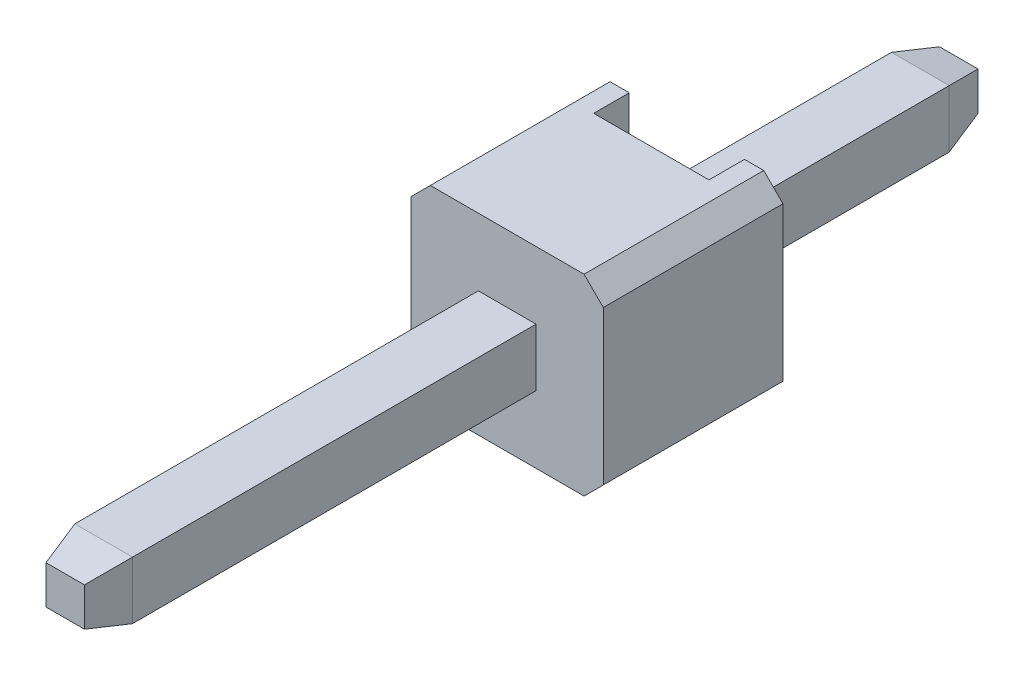
ISO-10303-21;
HEADER;
FILE_DESCRIPTION(('STEP AP214'),'2;1');
FILE_NAME('part.step','',(''),(''),'','','');
FILE_SCHEMA(('AUTOMOTIVE_DESIGN { 1 0 10303 214 1 1 1 1 }'));
ENDSEC;
DATA;
#1=APPLICATION_CONTEXT('core data for automotive mechanical design processes');
#2=APPLICATION_PROTOCOL_DEFINITION('international standard','automotive_design',2000,#1);
#3=PRODUCT_CONTEXT('',#1,'mechanical');
#4=PRODUCT('Part','Part','',(#3));
#5=PRODUCT_RELATED_PRODUCT_CATEGORY('part','',(#4));
#6=PRODUCT_DEFINITION_FORMATION('','',#4);
#7=PRODUCT_DEFINITION_CONTEXT('part definition',#1,'design');
#8=PRODUCT_DEFINITION('design','',#6,#7);
#9=PRODUCT_DEFINITION_SHAPE('','',#8);
#10=(LENGTH_UNIT() NAMED_UNIT(*) SI_UNIT(.MILLI.,.METRE.));
#11=(NAMED_UNIT(*) PLANE_ANGLE_UNIT() SI_UNIT($,.RADIAN.));
#12=(NAMED_UNIT(*) SI_UNIT($,.STERADIAN.) SOLID_ANGLE_UNIT());
#13=UNCERTAINTY_MEASURE_WITH_UNIT(LENGTH_MEASURE(1.E-05),#10,'distance_accuracy_value','');
#14=(GEOMETRIC_REPRESENTATION_CONTEXT(3) GLOBAL_UNCERTAINTY_ASSIGNED_CONTEXT((#13)) GLOBAL_UNIT_ASSIGNED_CONTEXT((#10,
#11,#12)) REPRESENTATION_CONTEXT('',''));
#15=CARTESIAN_POINT('',(0.,0.,0.));
#16=DIRECTION('',(0.,0.,1.));
#17=DIRECTION('',(1.,0.,0.));
#18=AXIS2_PLACEMENT_3D('',#15,#16,#17);
#19=CARTESIAN_POINT('',(0.,-0.2,6.5));
#20=DIRECTION('',(0.,0.970142500145391,-0.242535625036098));
#21=DIRECTION('',(-1.,0.,0.));
#22=AXIS2_PLACEMENT_3D('',#19,#20,#21);
#23=PLANE('',#22);
#24=DIRECTION('',(-0.23570226039596,-0.23570226039596,-0.942809041581841));
#25=VECTOR('',#24,1.);
#26=CARTESIAN_POINT('',(-0.188888888889,-0.188888888889,6.544444444444));
#27=LINE('',#26,#25);
#28=CARTESIAN_POINT('',(-0.2,-0.2,6.5));
#29=VERTEX_POINT('',#28);
#30=CARTESIAN_POINT('',(-0.3,-0.3,6.1));
#31=VERTEX_POINT('',#30);
#32=EDGE_CURVE('E26',#29,#31,#27,.T.);
#33=ORIENTED_EDGE('',*,*,#32,.T.);
#34=DIRECTION('',(-1.,0.,0.));
#35=VECTOR('',#34,1.);
#36=CARTESIAN_POINT('',(-0.3,-0.3,6.1));
#37=LINE('',#36,#35);
#38=CARTESIAN_POINT('',(0.3,-0.3,6.1));
#39=VERTEX_POINT('',#38);
#40=EDGE_CURVE('E395',#39,#31,#37,.T.);
#41=ORIENTED_EDGE('',*,*,#40,.F.);
#42=DIRECTION('',(-0.23570226039596,0.23570226039596,0.942809041581841));
#43=VECTOR('',#42,1.);
#44=CARTESIAN_POINT('',(0.188888888889,-0.188888888889,6.544444444444));
#45=LINE('',#44,#43);
#46=CARTESIAN_POINT('',(0.2,-0.2,6.5));
#47=VERTEX_POINT('',#46);
#48=EDGE_CURVE('E11',#39,#47,#45,.T.);
#49=ORIENTED_EDGE('',*,*,#48,.T.);
#50=DIRECTION('',(1.,0.,0.));
#51=VECTOR('',#50,1.);
#52=CARTESIAN_POINT('',(0.,-0.2,6.5));
#53=LINE('',#52,#51);
#54=EDGE_CURVE('E379',#29,#47,#53,.T.);
#55=ORIENTED_EDGE('',*,*,#54,.F.);
#56=EDGE_LOOP('',(#33,#41,#49,#55));
#57=FACE_BOUND('',#56,.T.);
#58=ADVANCED_FACE('F17',(#57),#23,.F.);
#59=CARTESIAN_POINT('',(0.2,0.,6.5));
#60=DIRECTION('',(-0.970142500145391,0.,-0.242535625036098));
#61=DIRECTION('',(-0.242535625036098,0.,0.970142500145391));
#62=AXIS2_PLACEMENT_3D('',#59,#60,#61);
#63=PLANE('',#62);
#64=DIRECTION('',(-0.23570226039596,-0.23570226039596,0.942809041581841));
#65=VECTOR('',#64,1.);
#66=CARTESIAN_POINT('',(0.188888888889,0.188888888889,6.544444444444));
#67=LINE('',#66,#65);
#68=CARTESIAN_POINT('',(0.3,0.3,6.1));
#69=VERTEX_POINT('',#68);
#70=CARTESIAN_POINT('',(0.2,0.2,6.5));
#71=VERTEX_POINT('',#70);
#72=EDGE_CURVE('E276',#69,#71,#67,.T.);
#73=ORIENTED_EDGE('',*,*,#72,.T.);
#74=DIRECTION('',(0.,1.,0.));
#75=VECTOR('',#74,1.);
#76=CARTESIAN_POINT('',(0.2,0.,6.5));
#77=LINE('',#76,#75);
#78=EDGE_CURVE('E383',#47,#71,#77,.T.);
#79=ORIENTED_EDGE('',*,*,#78,.F.);
#80=ORIENTED_EDGE('',*,*,#48,.F.);
#81=DIRECTION('',(0.,-1.,0.));
#82=VECTOR('',#81,1.);
#83=CARTESIAN_POINT('',(0.3,0.3,6.1));
#84=LINE('',#83,#82);
#85=EDGE_CURVE('E402',#69,#39,#84,.T.);
#86=ORIENTED_EDGE('',*,*,#85,.F.);
#87=EDGE_LOOP('',(#73,#79,#80,#86));
#88=FACE_BOUND('',#87,.T.);
#89=ADVANCED_FACE('F596',(#88),#63,.F.);
#90=CARTESIAN_POINT('',(-0.2,0.,6.5));
#91=DIRECTION('',(0.970142500145391,0.,-0.242535625036098));
#92=DIRECTION('',(0.,-1.,0.));
#93=AXIS2_PLACEMENT_3D('',#90,#91,#92);
#94=PLANE('',#93);
#95=DIRECTION('',(-0.23570226039596,0.23570226039596,-0.942809041581841));
#96=VECTOR('',#95,1.);
#97=CARTESIAN_POINT('',(-0.188888888889,0.188888888889,6.544444444444));
#98=LINE('',#97,#96);
#99=CARTESIAN_POINT('',(-0.2,0.2,6.5));
#100=VERTEX_POINT('',#99);
#101=CARTESIAN_POINT('',(-0.3,0.3,6.1));
#102=VERTEX_POINT('',#101);
#103=EDGE_CURVE('E278',#100,#102,#98,.T.);
#104=ORIENTED_EDGE('',*,*,#103,.T.);
#105=DIRECTION('',(0.,1.,0.));
#106=VECTOR('',#105,1.);
#107=CARTESIAN_POINT('',(-0.3,0.3,6.1));
#108=LINE('',#107,#106);
#109=EDGE_CURVE('E388',#31,#102,#108,.T.);
#110=ORIENTED_EDGE('',*,*,#109,.F.);
#111=ORIENTED_EDGE('',*,*,#32,.F.);
#112=DIRECTION('',(0.,-1.,0.));
#113=VECTOR('',#112,1.);
#114=CARTESIAN_POINT('',(-0.2,0.,6.5));
#115=LINE('',#114,#113);
#116=EDGE_CURVE('E325',#100,#29,#115,.T.);
#117=ORIENTED_EDGE('',*,*,#116,.F.);
#118=EDGE_LOOP('',(#104,#110,#111,#117));
#119=FACE_BOUND('',#118,.T.);
#120=ADVANCED_FACE('F608',(#119),#94,.F.);
#121=CARTESIAN_POINT('',(0.,0.2,6.5));
#122=DIRECTION('',(0.,-0.970142500145391,-0.242535625036098));
#123=DIRECTION('',(0.,0.242535625036098,-0.970142500145391));
#124=AXIS2_PLACEMENT_3D('',#121,#122,#123);
#125=PLANE('',#124);
#126=ORIENTED_EDGE('',*,*,#72,.F.);
#127=DIRECTION('',(1.,0.,0.));
#128=VECTOR('',#127,1.);
#129=CARTESIAN_POINT('',(-0.3,0.3,6.1));
#130=LINE('',#129,#128);
#131=EDGE_CURVE('E331',#102,#69,#130,.T.);
#132=ORIENTED_EDGE('',*,*,#131,.F.);
#133=ORIENTED_EDGE('',*,*,#103,.F.);
#134=DIRECTION('',(-1.,0.,0.));
#135=VECTOR('',#134,1.);
#136=CARTESIAN_POINT('',(0.,0.2,6.5));
#137=LINE('',#136,#135);
#138=EDGE_CURVE('E387',#71,#100,#137,.T.);
#139=ORIENTED_EDGE('',*,*,#138,.F.);
#140=EDGE_LOOP('',(#126,#132,#133,#139));
#141=FACE_BOUND('',#140,.T.);
#142=ADVANCED_FACE('F595',(#141),#125,.F.);
#143=CARTESIAN_POINT('',(-0.3,0.3,-2.4));
#144=DIRECTION('',(0.,0.970142500145391,-0.242535625036098));
#145=DIRECTION('',(-1.,0.,0.));
#146=AXIS2_PLACEMENT_3D('',#143,#144,#145);
#147=PLANE('',#146);
#148=DIRECTION('',(-0.23570226039596,-0.23570226039596,-0.942809041581841));
#149=VECTOR('',#148,1.);
#150=CARTESIAN_POINT('',(0.3,0.3,-2.4));
#151=LINE('',#150,#149);
#152=CARTESIAN_POINT('',(0.3,0.3,-2.4));
#153=VERTEX_POINT('',#152);
#154=CARTESIAN_POINT('',(0.2,0.2,-2.8));
#155=VERTEX_POINT('',#154);
#156=EDGE_CURVE('E273',#153,#155,#151,.T.);
#157=ORIENTED_EDGE('',*,*,#156,.T.);
#158=DIRECTION('',(1.,0.,0.));
#159=VECTOR('',#158,1.);
#160=CARTESIAN_POINT('',(0.3,0.2,-2.8));
#161=LINE('',#160,#159);
#162=CARTESIAN_POINT('',(-0.2,0.2,-2.8));
#163=VERTEX_POINT('',#162);
#164=EDGE_CURVE('E266',#163,#155,#161,.T.);
#165=ORIENTED_EDGE('',*,*,#164,.F.);
#166=DIRECTION('',(-0.23570226039596,0.23570226039596,0.942809041581841));
#167=VECTOR('',#166,1.);
#168=CARTESIAN_POINT('',(-0.3,0.3,-2.4));
#169=LINE('',#168,#167);
#170=CARTESIAN_POINT('',(-0.3,0.3,-2.4));
#171=VERTEX_POINT('',#170);
#172=EDGE_CURVE('E274',#163,#171,#169,.T.);
#173=ORIENTED_EDGE('',*,*,#172,.T.);
#174=DIRECTION('',(-1.,0.,0.));
#175=VECTOR('',#174,1.);
#176=CARTESIAN_POINT('',(-0.3,0.3,-2.4));
#177=LINE('',#176,#175);
#178=EDGE_CURVE('E242',#153,#171,#177,.T.);
#179=ORIENTED_EDGE('',*,*,#178,.F.);
#180=EDGE_LOOP('',(#157,#165,#173,#179));
#181=FACE_BOUND('',#180,.T.);
#182=ADVANCED_FACE('F423',(#181),#147,.T.);
#183=CARTESIAN_POINT('',(-0.3,0.3,-2.4));
#184=DIRECTION('',(-0.970142500145391,0.,-0.242535625036098));
#185=DIRECTION('',(-0.242535625036098,0.,0.970142500145391));
#186=AXIS2_PLACEMENT_3D('',#183,#184,#185);
#187=PLANE('',#186);
#188=DIRECTION('',(-0.23570226039596,-0.23570226039596,0.942809041581841));
#189=VECTOR('',#188,1.);
#190=CARTESIAN_POINT('',(-0.3,-0.3,-2.4));
#191=LINE('',#190,#189);
#192=CARTESIAN_POINT('',(-0.2,-0.2,-2.8));
#193=VERTEX_POINT('',#192);
#194=CARTESIAN_POINT('',(-0.3,-0.3,-2.4));
#195=VERTEX_POINT('',#194);
#196=EDGE_CURVE('E219',#193,#195,#191,.T.);
#197=ORIENTED_EDGE('',*,*,#196,.T.);
#198=DIRECTION('',(0.,-1.,0.));
#199=VECTOR('',#198,1.);
#200=CARTESIAN_POINT('',(-0.3,-0.3,-2.4));
#201=LINE('',#200,#199);
#202=EDGE_CURVE('E223',#171,#195,#201,.T.);
#203=ORIENTED_EDGE('',*,*,#202,.F.);
#204=ORIENTED_EDGE('',*,*,#172,.F.);
#205=DIRECTION('',(0.,1.,0.));
#206=VECTOR('',#205,1.);
#207=CARTESIAN_POINT('',(-0.2,0.3,-2.8));
#208=LINE('',#207,#206);
#209=EDGE_CURVE('E226',#193,#163,#208,.T.);
#210=ORIENTED_EDGE('',*,*,#209,.F.);
#211=EDGE_LOOP('',(#197,#203,#204,#210));
#212=FACE_BOUND('',#211,.T.);
#213=ADVANCED_FACE('F221',(#212),#187,.T.);
#214=CARTESIAN_POINT('',(0.3,0.3,-2.4));
#215=DIRECTION('',(0.970142500145391,0.,-0.242535625036098));
#216=DIRECTION('',(0.,-1.,0.));
#217=AXIS2_PLACEMENT_3D('',#214,#215,#216);
#218=PLANE('',#217);
#219=DIRECTION('',(-0.23570226039596,0.23570226039596,-0.942809041581841));
#220=VECTOR('',#219,1.);
#221=CARTESIAN_POINT('',(0.266666666667,-0.266666666667,-2.533333333333));
#222=LINE('',#221,#220);
#223=CARTESIAN_POINT('',(0.3,-0.3,-2.4));
#224=VERTEX_POINT('',#223);
#225=CARTESIAN_POINT('',(0.2,-0.2,-2.8));
#226=VERTEX_POINT('',#225);
#227=EDGE_CURVE('E39',#224,#226,#222,.T.);
#228=ORIENTED_EDGE('',*,*,#227,.T.);
#229=DIRECTION('',(0.,-1.,0.));
#230=VECTOR('',#229,1.);
#231=CARTESIAN_POINT('',(0.2,-0.3,-2.8));
#232=LINE('',#231,#230);
#233=EDGE_CURVE('E267',#155,#226,#232,.T.);
#234=ORIENTED_EDGE('',*,*,#233,.F.);
#235=ORIENTED_EDGE('',*,*,#156,.F.);
#236=DIRECTION('',(0.,1.,0.));
#237=VECTOR('',#236,1.);
#238=CARTESIAN_POINT('',(0.3,0.3,-2.4));
#239=LINE('',#238,#237);
#240=EDGE_CURVE('E260',#224,#153,#239,.T.);
#241=ORIENTED_EDGE('',*,*,#240,.F.);
#242=EDGE_LOOP('',(#228,#234,#235,#241));
#243=FACE_BOUND('',#242,.T.);
#244=ADVANCED_FACE('F419',(#243),#218,.T.);
#245=CARTESIAN_POINT('',(-0.3,-0.3,-2.4));
#246=DIRECTION('',(0.,-0.970142500145391,-0.242535625036098));
#247=DIRECTION('',(0.,0.242535625036098,-0.970142500145391));
#248=AXIS2_PLACEMENT_3D('',#245,#246,#247);
#249=PLANE('',#248);
#250=ORIENTED_EDGE('',*,*,#196,.F.);
#251=DIRECTION('',(-1.,0.,0.));
#252=VECTOR('',#251,1.);
#253=CARTESIAN_POINT('',(-0.3,-0.2,-2.8));
#254=LINE('',#253,#252);
#255=EDGE_CURVE('E231',#226,#193,#254,.T.);
#256=ORIENTED_EDGE('',*,*,#255,.F.);
#257=ORIENTED_EDGE('',*,*,#227,.F.);
#258=DIRECTION('',(1.,0.,0.));
#259=VECTOR('',#258,1.);
#260=CARTESIAN_POINT('',(0.3,-0.3,-2.4));
#261=LINE('',#260,#259);
#262=EDGE_CURVE('E245',#195,#224,#261,.T.);
#263=ORIENTED_EDGE('',*,*,#262,.F.);
#264=EDGE_LOOP('',(#250,#256,#257,#263));
#265=FACE_BOUND('',#264,.T.);
#266=ADVANCED_FACE('F246',(#265),#249,.T.);
#267=CARTESIAN_POINT('',(0.,0.,-2.8));
#268=DIRECTION('',(0.,0.,1.));
#269=DIRECTION('',(1.,0.,0.));
#270=AXIS2_PLACEMENT_3D('',#267,#268,#269);
#271=PLANE('',#270);
#272=ORIENTED_EDGE('',*,*,#209,.T.);
#273=ORIENTED_EDGE('',*,*,#164,.T.);
#274=ORIENTED_EDGE('',*,*,#233,.T.);
#275=ORIENTED_EDGE('',*,*,#255,.T.);
#276=EDGE_LOOP('',(#272,#273,#274,#275));
#277=FACE_BOUND('',#276,.T.);
#278=ADVANCED_FACE('F640',(#277),#271,.F.);
#279=CARTESIAN_POINT('',(-0.3,0.3,-2.8));
#280=DIRECTION('',(0.,1.,0.));
#281=DIRECTION('',(1.,0.,0.));
#282=AXIS2_PLACEMENT_3D('',#279,#280,#281);
#283=PLANE('',#282);
#284=DIRECTION('',(0.,0.,1.));
#285=VECTOR('',#284,1.);
#286=CARTESIAN_POINT('',(0.3,0.3,-2.8));
#287=LINE('',#286,#285);
#288=CARTESIAN_POINT('',(0.3,0.3,0.4));
#289=VERTEX_POINT('',#288);
#290=EDGE_CURVE('E255',#153,#289,#287,.T.);
#291=ORIENTED_EDGE('',*,*,#290,.F.);
#292=ORIENTED_EDGE('',*,*,#178,.T.);
#293=DIRECTION('',(0.,0.,1.));
#294=VECTOR('',#293,1.);
#295=CARTESIAN_POINT('',(-0.3,0.3,-2.8));
#296=LINE('',#295,#294);
#297=CARTESIAN_POINT('',(-0.3,0.3,0.4));
#298=VERTEX_POINT('',#297);
#299=EDGE_CURVE('E240',#171,#298,#296,.T.);
#300=ORIENTED_EDGE('',*,*,#299,.T.);
#301=DIRECTION('',(-1.,0.,0.));
#302=VECTOR('',#301,1.);
#303=CARTESIAN_POINT('',(0.,0.3,0.4));
#304=LINE('',#303,#302);
#305=EDGE_CURVE('E427',#289,#298,#304,.T.);
#306=ORIENTED_EDGE('',*,*,#305,.F.);
#307=EDGE_LOOP('',(#291,#292,#300,#306));
#308=FACE_BOUND('',#307,.T.);
#309=ADVANCED_FACE('F425',(#308),#283,.T.);
#310=CARTESIAN_POINT('',(-0.3,0.3,-2.8));
#311=DIRECTION('',(-1.,0.,0.));
#312=DIRECTION('',(0.,1.,0.));
#313=AXIS2_PLACEMENT_3D('',#310,#311,#312);
#314=PLANE('',#313);
#315=ORIENTED_EDGE('',*,*,#299,.F.);
#316=ORIENTED_EDGE('',*,*,#202,.T.);
#317=DIRECTION('',(0.,0.,1.));
#318=VECTOR('',#317,1.);
#319=CARTESIAN_POINT('',(-0.3,-0.3,-2.8));
#320=LINE('',#319,#318);
#321=CARTESIAN_POINT('',(-0.3,-0.3,0.4));
#322=VERTEX_POINT('',#321);
#323=EDGE_CURVE('E238',#195,#322,#320,.T.);
#324=ORIENTED_EDGE('',*,*,#323,.T.);
#325=DIRECTION('',(0.,-1.,0.));
#326=VECTOR('',#325,1.);
#327=CARTESIAN_POINT('',(-0.3,0.,0.4));
#328=LINE('',#327,#326);
#329=EDGE_CURVE('E433',#298,#322,#328,.T.);
#330=ORIENTED_EDGE('',*,*,#329,.F.);
#331=EDGE_LOOP('',(#315,#316,#324,#330));
#332=FACE_BOUND('',#331,.T.);
#333=ADVANCED_FACE('F235',(#332),#314,.T.);
#334=CARTESIAN_POINT('',(-0.3,-0.3,-2.8));
#335=DIRECTION('',(0.,-1.,0.));
#336=DIRECTION('',(0.,0.,-1.));
#337=AXIS2_PLACEMENT_3D('',#334,#335,#336);
#338=PLANE('',#337);
#339=ORIENTED_EDGE('',*,*,#323,.F.);
#340=ORIENTED_EDGE('',*,*,#262,.T.);
#341=DIRECTION('',(0.,0.,1.));
#342=VECTOR('',#341,1.);
#343=CARTESIAN_POINT('',(0.3,-0.3,-2.8));
#344=LINE('',#343,#342);
#345=CARTESIAN_POINT('',(0.3,-0.3,0.4));
#346=VERTEX_POINT('',#345);
#347=EDGE_CURVE('E406',#224,#346,#344,.T.);
#348=ORIENTED_EDGE('',*,*,#347,.T.);
#349=DIRECTION('',(1.,0.,0.));
#350=VECTOR('',#349,1.);
#351=CARTESIAN_POINT('',(0.,-0.3,0.4));
#352=LINE('',#351,#350);
#353=EDGE_CURVE('E253',#322,#346,#352,.T.);
#354=ORIENTED_EDGE('',*,*,#353,.F.);
#355=EDGE_LOOP('',(#339,#340,#348,#354));
#356=FACE_BOUND('',#355,.T.);
#357=ADVANCED_FACE('F251',(#356),#338,.T.);
#358=CARTESIAN_POINT('',(0.3,0.3,-2.8));
#359=DIRECTION('',(1.,0.,0.));
#360=DIRECTION('',(0.,1.,0.));
#361=AXIS2_PLACEMENT_3D('',#358,#359,#360);
#362=PLANE('',#361);
#363=ORIENTED_EDGE('',*,*,#347,.F.);
#364=ORIENTED_EDGE('',*,*,#240,.T.);
#365=ORIENTED_EDGE('',*,*,#290,.T.);
#366=DIRECTION('',(0.,1.,0.));
#367=VECTOR('',#366,1.);
#368=CARTESIAN_POINT('',(0.3,0.,0.4));
#369=LINE('',#368,#367);
#370=EDGE_CURVE('E434',#346,#289,#369,.T.);
#371=ORIENTED_EDGE('',*,*,#370,.F.);
#372=EDGE_LOOP('',(#363,#364,#365,#371));
#373=FACE_BOUND('',#372,.T.);
#374=ADVANCED_FACE('F415',(#373),#362,.T.);
#375=CARTESIAN_POINT('',(0.3,0.3,-2.8));
#376=DIRECTION('',(1.,0.,0.));
#377=DIRECTION('',(0.,1.,0.));
#378=AXIS2_PLACEMENT_3D('',#375,#376,#377);
#379=PLANE('',#378);
#380=DIRECTION('',(0.,0.,1.));
#381=VECTOR('',#380,1.);
#382=CARTESIAN_POINT('',(0.3,0.3,-2.8));
#383=LINE('',#382,#381);
#384=CARTESIAN_POINT('',(0.3,0.3,1.9));
#385=VERTEX_POINT('',#384);
#386=EDGE_CURVE('E335',#385,#69,#383,.T.);
#387=ORIENTED_EDGE('',*,*,#386,.T.);
#388=ORIENTED_EDGE('',*,*,#85,.T.);
#389=DIRECTION('',(0.,0.,1.));
#390=VECTOR('',#389,1.);
#391=CARTESIAN_POINT('',(0.3,-0.3,-2.8));
#392=LINE('',#391,#390);
#393=CARTESIAN_POINT('',(0.3,-0.3,1.9));
#394=VERTEX_POINT('',#393);
#395=EDGE_CURVE('E391',#394,#39,#392,.T.);
#396=ORIENTED_EDGE('',*,*,#395,.F.);
#397=DIRECTION('',(0.,1.,0.));
#398=VECTOR('',#397,1.);
#399=CARTESIAN_POINT('',(0.3,0.,1.9));
#400=LINE('',#399,#398);
#401=EDGE_CURVE('E369',#394,#385,#400,.T.);
#402=ORIENTED_EDGE('',*,*,#401,.T.);
#403=EDGE_LOOP('',(#387,#388,#396,#402));
#404=FACE_BOUND('',#403,.T.);
#405=ADVANCED_FACE('F599',(#404),#379,.T.);
#406=CARTESIAN_POINT('',(-0.3,-0.3,-2.8));
#407=DIRECTION('',(0.,-1.,0.));
#408=DIRECTION('',(0.,0.,-1.));
#409=AXIS2_PLACEMENT_3D('',#406,#407,#408);
#410=PLANE('',#409);
#411=ORIENTED_EDGE('',*,*,#395,.T.);
#412=ORIENTED_EDGE('',*,*,#40,.T.);
#413=DIRECTION('',(0.,0.,1.));
#414=VECTOR('',#413,1.);
#415=CARTESIAN_POINT('',(-0.3,-0.3,-2.8));
#416=LINE('',#415,#414);
#417=CARTESIAN_POINT('',(-0.3,-0.3,1.9));
#418=VERTEX_POINT('',#417);
#419=EDGE_CURVE('E356',#418,#31,#416,.T.);
#420=ORIENTED_EDGE('',*,*,#419,.F.);
#421=DIRECTION('',(1.,0.,0.));
#422=VECTOR('',#421,1.);
#423=CARTESIAN_POINT('',(0.,-0.3,1.9));
#424=LINE('',#423,#422);
#425=EDGE_CURVE('E364',#418,#394,#424,.T.);
#426=ORIENTED_EDGE('',*,*,#425,.T.);
#427=EDGE_LOOP('',(#411,#412,#420,#426));
#428=FACE_BOUND('',#427,.T.);
#429=ADVANCED_FACE('F602',(#428),#410,.T.);
#430=CARTESIAN_POINT('',(-0.3,0.3,-2.8));
#431=DIRECTION('',(-1.,0.,0.));
#432=DIRECTION('',(0.,1.,0.));
#433=AXIS2_PLACEMENT_3D('',#430,#431,#432);
#434=PLANE('',#433);
#435=ORIENTED_EDGE('',*,*,#419,.T.);
#436=ORIENTED_EDGE('',*,*,#109,.T.);
#437=DIRECTION('',(0.,0.,1.));
#438=VECTOR('',#437,1.);
#439=CARTESIAN_POINT('',(-0.3,0.3,-2.8));
#440=LINE('',#439,#438);
#441=CARTESIAN_POINT('',(-0.3,0.3,1.9));
#442=VERTEX_POINT('',#441);
#443=EDGE_CURVE('E336',#442,#102,#440,.T.);
#444=ORIENTED_EDGE('',*,*,#443,.F.);
#445=DIRECTION('',(0.,-1.,0.));
#446=VECTOR('',#445,1.);
#447=CARTESIAN_POINT('',(-0.3,0.,1.9));
#448=LINE('',#447,#446);
#449=EDGE_CURVE('E368',#442,#418,#448,.T.);
#450=ORIENTED_EDGE('',*,*,#449,.T.);
#451=EDGE_LOOP('',(#435,#436,#444,#450));
#452=FACE_BOUND('',#451,.T.);
#453=ADVANCED_FACE('F592',(#452),#434,.T.);
#454=CARTESIAN_POINT('',(-0.3,0.3,-2.8));
#455=DIRECTION('',(0.,1.,0.));
#456=DIRECTION('',(1.,0.,0.));
#457=AXIS2_PLACEMENT_3D('',#454,#455,#456);
#458=PLANE('',#457);
#459=ORIENTED_EDGE('',*,*,#443,.T.);
#460=ORIENTED_EDGE('',*,*,#131,.T.);
#461=ORIENTED_EDGE('',*,*,#386,.F.);
#462=DIRECTION('',(-1.,0.,0.));
#463=VECTOR('',#462,1.);
#464=CARTESIAN_POINT('',(0.,0.3,1.9));
#465=LINE('',#464,#463);
#466=EDGE_CURVE('E370',#385,#442,#465,.T.);
#467=ORIENTED_EDGE('',*,*,#466,.T.);
#468=EDGE_LOOP('',(#459,#460,#461,#467));
#469=FACE_BOUND('',#468,.T.);
#470=ADVANCED_FACE('F586',(#469),#458,.T.);
#471=CARTESIAN_POINT('',(0.,0.,6.5));
#472=DIRECTION('',(0.,0.,1.));
#473=DIRECTION('',(1.,0.,0.));
#474=AXIS2_PLACEMENT_3D('',#471,#472,#473);
#475=PLANE('',#474);
#476=ORIENTED_EDGE('',*,*,#116,.T.);
#477=ORIENTED_EDGE('',*,*,#54,.T.);
#478=ORIENTED_EDGE('',*,*,#78,.T.);
#479=ORIENTED_EDGE('',*,*,#138,.T.);
#480=EDGE_LOOP('',(#476,#477,#478,#479));
#481=FACE_BOUND('',#480,.T.);
#482=ADVANCED_FACE('F610',(#481),#475,.T.);
#483=CARTESIAN_POINT('',(0.,0.,0.03));
#484=DIRECTION('',(0.,0.,1.));
#485=DIRECTION('',(1.,0.,0.));
#486=AXIS2_PLACEMENT_3D('',#483,#484,#485);
#487=PLANE('',#486);
#488=DIRECTION('',(0.,1.,0.));
#489=VECTOR('',#488,1.);
#490=CARTESIAN_POINT('',(-0.6,1.,0.03));
#491=LINE('',#490,#489);
#492=CARTESIAN_POINT('',(-0.6,-1.,0.03));
#493=VERTEX_POINT('',#492);
#494=CARTESIAN_POINT('',(-0.6,1.,0.03));
#495=VERTEX_POINT('',#494);
#496=EDGE_CURVE('E322',#493,#495,#491,.T.);
#497=ORIENTED_EDGE('',*,*,#496,.F.);
#498=DIRECTION('',(1.,0.,0.));
#499=VECTOR('',#498,1.);
#500=CARTESIAN_POINT('',(-0.8,-1.,0.03));
#501=LINE('',#500,#499);
#502=CARTESIAN_POINT('',(-0.8,-1.,0.03));
#503=VERTEX_POINT('',#502);
#504=EDGE_CURVE('E473',#503,#493,#501,.T.);
#505=ORIENTED_EDGE('',*,*,#504,.F.);
#506=DIRECTION('',(0.707106781186548,-0.707106781186548,0.));
#507=VECTOR('',#506,1.);
#508=CARTESIAN_POINT('',(-1.,-0.8,0.03));
#509=LINE('',#508,#507);
#510=CARTESIAN_POINT('',(-1.,-0.8,0.03));
#511=VERTEX_POINT('',#510);
#512=EDGE_CURVE('E481',#511,#503,#509,.T.);
#513=ORIENTED_EDGE('',*,*,#512,.F.);
#514=DIRECTION('',(0.,-1.,0.));
#515=VECTOR('',#514,1.);
#516=CARTESIAN_POINT('',(-1.,0.8,0.03));
#517=LINE('',#516,#515);
#518=CARTESIAN_POINT('',(-1.,0.8,0.03));
#519=VERTEX_POINT('',#518);
#520=EDGE_CURVE('E357',#519,#511,#517,.T.);
#521=ORIENTED_EDGE('',*,*,#520,.F.);
#522=DIRECTION('',(-0.707106781186548,-0.707106781186548,0.));
#523=VECTOR('',#522,1.);
#524=CARTESIAN_POINT('',(-0.8,1.,0.03));
#525=LINE('',#524,#523);
#526=CARTESIAN_POINT('',(-0.8,1.,0.03));
#527=VERTEX_POINT('',#526);
#528=EDGE_CURVE('E348',#527,#519,#525,.T.);
#529=ORIENTED_EDGE('',*,*,#528,.F.);
#530=DIRECTION('',(-1.,0.,0.));
#531=VECTOR('',#530,1.);
#532=CARTESIAN_POINT('',(-0.6,1.,0.03));
#533=LINE('',#532,#531);
#534=EDGE_CURVE('E317',#495,#527,#533,.T.);
#535=ORIENTED_EDGE('',*,*,#534,.F.);
#536=EDGE_LOOP('',(#497,#505,#513,#521,#529,#535));
#537=FACE_BOUND('',#536,.T.);
#538=ADVANCED_FACE('F612',(#537),#487,.F.);
#539=CARTESIAN_POINT('',(-0.6,1.,0.43));
#540=DIRECTION('',(-1.,0.,0.));
#541=DIRECTION('',(0.,0.,1.));
#542=AXIS2_PLACEMENT_3D('',#539,#540,#541);
#543=PLANE('',#542);
#544=DIRECTION('',(0.,0.,-1.));
#545=VECTOR('',#544,1.);
#546=CARTESIAN_POINT('',(-0.6,1.,0.43));
#547=LINE('',#546,#545);
#548=CARTESIAN_POINT('',(-0.6,1.,0.4));
#549=VERTEX_POINT('',#548);
#550=EDGE_CURVE('E314',#549,#495,#547,.T.);
#551=ORIENTED_EDGE('',*,*,#550,.F.);
#552=DIRECTION('',(0.,-1.,0.));
#553=VECTOR('',#552,1.);
#554=CARTESIAN_POINT('',(-0.6,0.,0.4));
#555=LINE('',#554,#553);
#556=CARTESIAN_POINT('',(-0.6,-1.,0.4));
#557=VERTEX_POINT('',#556);
#558=EDGE_CURVE('E456',#549,#557,#555,.T.);
#559=ORIENTED_EDGE('',*,*,#558,.T.);
#560=DIRECTION('',(0.,0.,-1.));
#561=VECTOR('',#560,1.);
#562=CARTESIAN_POINT('',(-0.6,-1.,0.43));
#563=LINE('',#562,#561);
#564=EDGE_CURVE('E469',#557,#493,#563,.T.);
#565=ORIENTED_EDGE('',*,*,#564,.T.);
#566=ORIENTED_EDGE('',*,*,#496,.T.);
#567=EDGE_LOOP('',(#551,#559,#565,#566));
#568=FACE_BOUND('',#567,.T.);
#569=ADVANCED_FACE('F619',(#568),#543,.F.);
#570=CARTESIAN_POINT('',(0.,0.,0.03));
#571=DIRECTION('',(0.,0.,1.));
#572=DIRECTION('',(1.,0.,0.));
#573=AXIS2_PLACEMENT_3D('',#570,#571,#572);
#574=PLANE('',#573);
#575=DIRECTION('',(0.,-1.,0.));
#576=VECTOR('',#575,1.);
#577=CARTESIAN_POINT('',(0.6,1.,0.03));
#578=LINE('',#577,#576);
#579=CARTESIAN_POINT('',(0.6,1.,0.03));
#580=VERTEX_POINT('',#579);
#581=CARTESIAN_POINT('',(0.6,-1.,0.03));
#582=VERTEX_POINT('',#581);
#583=EDGE_CURVE('E326',#580,#582,#578,.T.);
#584=ORIENTED_EDGE('',*,*,#583,.F.);
#585=DIRECTION('',(-1.,0.,0.));
#586=VECTOR('',#585,1.);
#587=CARTESIAN_POINT('',(0.8,1.,0.03));
#588=LINE('',#587,#586);
#589=CARTESIAN_POINT('',(0.8,1.,0.03));
#590=VERTEX_POINT('',#589);
#591=EDGE_CURVE('E340',#590,#580,#588,.T.);
#592=ORIENTED_EDGE('',*,*,#591,.F.);
#593=DIRECTION('',(-0.707106781186548,0.707106781186548,0.));
#594=VECTOR('',#593,1.);
#595=CARTESIAN_POINT('',(1.,0.8,0.03));
#596=LINE('',#595,#594);
#597=CARTESIAN_POINT('',(1.,0.8,0.03));
#598=VERTEX_POINT('',#597);
#599=EDGE_CURVE('E302',#598,#590,#596,.T.);
#600=ORIENTED_EDGE('',*,*,#599,.F.);
#601=DIRECTION('',(0.,1.,0.));
#602=VECTOR('',#601,1.);
#603=CARTESIAN_POINT('',(1.,-0.8,0.03));
#604=LINE('',#603,#602);
#605=CARTESIAN_POINT('',(1.,-0.8,0.03));
#606=VERTEX_POINT('',#605);
#607=EDGE_CURVE('E532',#606,#598,#604,.T.);
#608=ORIENTED_EDGE('',*,*,#607,.F.);
#609=DIRECTION('',(0.707106781186548,0.707106781186548,0.));
#610=VECTOR('',#609,1.);
#611=CARTESIAN_POINT('',(0.8,-1.,0.03));
#612=LINE('',#611,#610);
#613=CARTESIAN_POINT('',(0.8,-1.,0.03));
#614=VERTEX_POINT('',#613);
#615=EDGE_CURVE('E518',#614,#606,#612,.T.);
#616=ORIENTED_EDGE('',*,*,#615,.F.);
#617=DIRECTION('',(1.,0.,0.));
#618=VECTOR('',#617,1.);
#619=CARTESIAN_POINT('',(0.6,-1.,0.03));
#620=LINE('',#619,#618);
#621=EDGE_CURVE('E490',#582,#614,#620,.T.);
#622=ORIENTED_EDGE('',*,*,#621,.F.);
#623=EDGE_LOOP('',(#584,#592,#600,#608,#616,#622));
#624=FACE_BOUND('',#623,.T.);
#625=ADVANCED_FACE('F553',(#624),#574,.F.);
#626=CARTESIAN_POINT('',(0.6,1.,0.43));
#627=DIRECTION('',(1.,0.,0.));
#628=DIRECTION('',(0.,1.,0.));
#629=AXIS2_PLACEMENT_3D('',#626,#627,#628);
#630=PLANE('',#629);
#631=DIRECTION('',(0.,0.,-1.));
#632=VECTOR('',#631,1.);
#633=CARTESIAN_POINT('',(0.6,-1.,0.43));
#634=LINE('',#633,#632);
#635=CARTESIAN_POINT('',(0.6,-1.,0.4));
#636=VERTEX_POINT('',#635);
#637=EDGE_CURVE('E472',#636,#582,#634,.T.);
#638=ORIENTED_EDGE('',*,*,#637,.F.);
#639=DIRECTION('',(0.,1.,0.));
#640=VECTOR('',#639,1.);
#641=CARTESIAN_POINT('',(0.6,0.,0.4));
#642=LINE('',#641,#640);
#643=CARTESIAN_POINT('',(0.6,1.,0.4));
#644=VERTEX_POINT('',#643);
#645=EDGE_CURVE('E464',#636,#644,#642,.T.);
#646=ORIENTED_EDGE('',*,*,#645,.T.);
#647=DIRECTION('',(0.,0.,-1.));
#648=VECTOR('',#647,1.);
#649=CARTESIAN_POINT('',(0.6,1.,0.43));
#650=LINE('',#649,#648);
#651=EDGE_CURVE('E344',#644,#580,#650,.T.);
#652=ORIENTED_EDGE('',*,*,#651,.T.);
#653=ORIENTED_EDGE('',*,*,#583,.T.);
#654=EDGE_LOOP('',(#638,#646,#652,#653));
#655=FACE_BOUND('',#654,.T.);
#656=ADVANCED_FACE('F706',(#655),#630,.F.);
#657=CARTESIAN_POINT('',(0.,0.,1.9));
#658=DIRECTION('',(0.,0.,1.));
#659=DIRECTION('',(1.,0.,0.));
#660=AXIS2_PLACEMENT_3D('',#657,#658,#659);
#661=PLANE('',#660);
#662=DIRECTION('',(0.707106781186548,-0.707106781186548,0.));
#663=VECTOR('',#662,1.);
#664=CARTESIAN_POINT('',(-1.,-0.8,1.9));
#665=LINE('',#664,#663);
#666=CARTESIAN_POINT('',(-1.,-0.8,1.9));
#667=VERTEX_POINT('',#666);
#668=CARTESIAN_POINT('',(-0.8,-1.,1.9));
#669=VERTEX_POINT('',#668);
#670=EDGE_CURVE('E504',#667,#669,#665,.T.);
#671=ORIENTED_EDGE('',*,*,#670,.T.);
#672=DIRECTION('',(1.,0.,0.));
#673=VECTOR('',#672,1.);
#674=CARTESIAN_POINT('',(-0.8,-1.,1.9));
#675=LINE('',#674,#673);
#676=CARTESIAN_POINT('',(0.8,-1.,1.9));
#677=VERTEX_POINT('',#676);
#678=EDGE_CURVE('E514',#669,#677,#675,.T.);
#679=ORIENTED_EDGE('',*,*,#678,.T.);
#680=DIRECTION('',(0.707106781186548,0.707106781186548,0.));
#681=VECTOR('',#680,1.);
#682=CARTESIAN_POINT('',(0.8,-1.,1.9));
#683=LINE('',#682,#681);
#684=CARTESIAN_POINT('',(1.,-0.8,1.9));
#685=VERTEX_POINT('',#684);
#686=EDGE_CURVE('E529',#677,#685,#683,.T.);
#687=ORIENTED_EDGE('',*,*,#686,.T.);
#688=DIRECTION('',(0.,1.,0.));
#689=VECTOR('',#688,1.);
#690=CARTESIAN_POINT('',(1.,0.8,1.9));
#691=LINE('',#690,#689);
#692=CARTESIAN_POINT('',(1.,0.8,1.9));
#693=VERTEX_POINT('',#692);
#694=EDGE_CURVE('E299',#685,#693,#691,.T.);
#695=ORIENTED_EDGE('',*,*,#694,.T.);
#696=DIRECTION('',(-0.707106781186548,0.707106781186548,0.));
#697=VECTOR('',#696,1.);
#698=CARTESIAN_POINT('',(0.8,1.,1.9));
#699=LINE('',#698,#697);
#700=CARTESIAN_POINT('',(0.8,1.,1.9));
#701=VERTEX_POINT('',#700);
#702=EDGE_CURVE('E310',#693,#701,#699,.T.);
#703=ORIENTED_EDGE('',*,*,#702,.T.);
#704=DIRECTION('',(-1.,0.,0.));
#705=VECTOR('',#704,1.);
#706=CARTESIAN_POINT('',(-0.8,1.,1.9));
#707=LINE('',#706,#705);
#708=CARTESIAN_POINT('',(-0.8,1.,1.9));
#709=VERTEX_POINT('',#708);
#710=EDGE_CURVE('E330',#701,#709,#707,.T.);
#711=ORIENTED_EDGE('',*,*,#710,.T.);
#712=DIRECTION('',(-0.707106781186548,-0.707106781186548,0.));
#713=VECTOR('',#712,1.);
#714=CARTESIAN_POINT('',(-1.,0.8,1.9));
#715=LINE('',#714,#713);
#716=CARTESIAN_POINT('',(-1.,0.8,1.9));
#717=VERTEX_POINT('',#716);
#718=EDGE_CURVE('E361',#709,#717,#715,.T.);
#719=ORIENTED_EDGE('',*,*,#718,.T.);
#720=DIRECTION('',(0.,-1.,0.));
#721=VECTOR('',#720,1.);
#722=CARTESIAN_POINT('',(-1.,0.8,1.9));
#723=LINE('',#722,#721);
#724=EDGE_CURVE('E360',#717,#667,#723,.T.);
#725=ORIENTED_EDGE('',*,*,#724,.T.);
#726=EDGE_LOOP('',(#671,#679,#687,#695,#703,#711,#719,#725));
#727=FACE_BOUND('',#726,.T.);
#728=ORIENTED_EDGE('',*,*,#401,.F.);
#729=ORIENTED_EDGE('',*,*,#425,.F.);
#730=ORIENTED_EDGE('',*,*,#449,.F.);
#731=ORIENTED_EDGE('',*,*,#466,.F.);
#732=EDGE_LOOP('',(#728,#729,#730,#731));
#733=FACE_BOUND('',#732,.T.);
#734=ADVANCED_FACE('F546',(#727,#733),#661,.T.);
#735=CARTESIAN_POINT('',(-1.,0.8,1.9));
#736=DIRECTION('',(1.,0.,0.));
#737=DIRECTION('',(0.,1.,0.));
#738=AXIS2_PLACEMENT_3D('',#735,#736,#737);
#739=PLANE('',#738);
#740=DIRECTION('',(0.,0.,-1.));
#741=VECTOR('',#740,1.);
#742=CARTESIAN_POINT('',(-1.,0.8,1.9));
#743=LINE('',#742,#741);
#744=EDGE_CURVE('E352',#717,#519,#743,.T.);
#745=ORIENTED_EDGE('',*,*,#744,.T.);
#746=ORIENTED_EDGE('',*,*,#520,.T.);
#747=DIRECTION('',(0.,0.,-1.));
#748=VECTOR('',#747,1.);
#749=CARTESIAN_POINT('',(-1.,-0.8,1.9));
#750=LINE('',#749,#748);
#751=EDGE_CURVE('E486',#667,#511,#750,.T.);
#752=ORIENTED_EDGE('',*,*,#751,.F.);
#753=ORIENTED_EDGE('',*,*,#724,.F.);
#754=EDGE_LOOP('',(#745,#746,#752,#753));
#755=FACE_BOUND('',#754,.T.);
#756=ADVANCED_FACE('F563',(#755),#739,.F.);
#757=CARTESIAN_POINT('',(-1.,0.8,1.9));
#758=DIRECTION('',(0.707106781186548,-0.707106781186548,0.));
#759=DIRECTION('',(0.,0.,-1.));
#760=AXIS2_PLACEMENT_3D('',#757,#758,#759);
#761=PLANE('',#760);
#762=DIRECTION('',(0.,0.,-1.));
#763=VECTOR('',#762,1.);
#764=CARTESIAN_POINT('',(-0.8,1.,1.9));
#765=LINE('',#764,#763);
#766=EDGE_CURVE('E321',#709,#527,#765,.T.);
#767=ORIENTED_EDGE('',*,*,#766,.T.);
#768=ORIENTED_EDGE('',*,*,#528,.T.);
#769=ORIENTED_EDGE('',*,*,#744,.F.);
#770=ORIENTED_EDGE('',*,*,#718,.F.);
#771=EDGE_LOOP('',(#767,#768,#769,#770));
#772=FACE_BOUND('',#771,.T.);
#773=ADVANCED_FACE('F561',(#772),#761,.F.);
#774=CARTESIAN_POINT('',(-0.8,1.,1.9));
#775=DIRECTION('',(0.,-1.,0.));
#776=DIRECTION('',(0.,0.,-1.));
#777=AXIS2_PLACEMENT_3D('',#774,#775,#776);
#778=PLANE('',#777);
#779=DIRECTION('',(-1.,0.,0.));
#780=VECTOR('',#779,1.);
#781=CARTESIAN_POINT('',(-0.8,1.,0.4));
#782=LINE('',#781,#780);
#783=EDGE_CURVE('E463',#644,#549,#782,.T.);
#784=ORIENTED_EDGE('',*,*,#783,.T.);
#785=ORIENTED_EDGE('',*,*,#550,.T.);
#786=ORIENTED_EDGE('',*,*,#534,.T.);
#787=ORIENTED_EDGE('',*,*,#766,.F.);
#788=ORIENTED_EDGE('',*,*,#710,.F.);
#789=DIRECTION('',(0.,0.,-1.));
#790=VECTOR('',#789,1.);
#791=CARTESIAN_POINT('',(0.8,1.,1.9));
#792=LINE('',#791,#790);
#793=EDGE_CURVE('E306',#701,#590,#792,.T.);
#794=ORIENTED_EDGE('',*,*,#793,.T.);
#795=ORIENTED_EDGE('',*,*,#591,.T.);
#796=ORIENTED_EDGE('',*,*,#651,.F.);
#797=EDGE_LOOP('',(#784,#785,#786,#787,#788,#794,#795,#796));
#798=FACE_BOUND('',#797,.T.);
#799=ADVANCED_FACE('F556',(#798),#778,.F.);
#800=CARTESIAN_POINT('',(0.8,1.,1.9));
#801=DIRECTION('',(-0.707106781186548,-0.707106781186548,0.));
#802=DIRECTION('',(-0.707106781186548,0.707106781186548,0.));
#803=AXIS2_PLACEMENT_3D('',#800,#801,#802);
#804=PLANE('',#803);
#805=DIRECTION('',(0.,0.,-1.));
#806=VECTOR('',#805,1.);
#807=CARTESIAN_POINT('',(1.,0.8,1.9));
#808=LINE('',#807,#806);
#809=EDGE_CURVE('E297',#693,#598,#808,.T.);
#810=ORIENTED_EDGE('',*,*,#809,.T.);
#811=ORIENTED_EDGE('',*,*,#599,.T.);
#812=ORIENTED_EDGE('',*,*,#793,.F.);
#813=ORIENTED_EDGE('',*,*,#702,.F.);
#814=EDGE_LOOP('',(#810,#811,#812,#813));
#815=FACE_BOUND('',#814,.T.);
#816=ADVANCED_FACE('F541',(#815),#804,.F.);
#817=CARTESIAN_POINT('',(1.,0.8,1.9));
#818=DIRECTION('',(-1.,0.,0.));
#819=DIRECTION('',(0.,1.,0.));
#820=AXIS2_PLACEMENT_3D('',#817,#818,#819);
#821=PLANE('',#820);
#822=DIRECTION('',(0.,0.,-1.));
#823=VECTOR('',#822,1.);
#824=CARTESIAN_POINT('',(1.,-0.8,1.9));
#825=LINE('',#824,#823);
#826=EDGE_CURVE('E525',#685,#606,#825,.T.);
#827=ORIENTED_EDGE('',*,*,#826,.T.);
#828=ORIENTED_EDGE('',*,*,#607,.T.);
#829=ORIENTED_EDGE('',*,*,#809,.F.);
#830=ORIENTED_EDGE('',*,*,#694,.F.);
#831=EDGE_LOOP('',(#827,#828,#829,#830));
#832=FACE_BOUND('',#831,.T.);
#833=ADVANCED_FACE('F543',(#832),#821,.F.);
#834=CARTESIAN_POINT('',(0.8,-1.,1.9));
#835=DIRECTION('',(-0.707106781186548,0.707106781186548,0.));
#836=DIRECTION('',(0.,0.,1.));
#837=AXIS2_PLACEMENT_3D('',#834,#835,#836);
#838=PLANE('',#837);
#839=DIRECTION('',(0.,0.,-1.));
#840=VECTOR('',#839,1.);
#841=CARTESIAN_POINT('',(0.8,-1.,1.9));
#842=LINE('',#841,#840);
#843=EDGE_CURVE('E494',#677,#614,#842,.T.);
#844=ORIENTED_EDGE('',*,*,#843,.T.);
#845=ORIENTED_EDGE('',*,*,#615,.T.);
#846=ORIENTED_EDGE('',*,*,#826,.F.);
#847=ORIENTED_EDGE('',*,*,#686,.F.);
#848=EDGE_LOOP('',(#844,#845,#846,#847));
#849=FACE_BOUND('',#848,.T.);
#850=ADVANCED_FACE('F550',(#849),#838,.F.);
#851=CARTESIAN_POINT('',(-0.8,-1.,1.9));
#852=DIRECTION('',(0.,1.,0.));
#853=DIRECTION('',(1.,0.,0.));
#854=AXIS2_PLACEMENT_3D('',#851,#852,#853);
#855=PLANE('',#854);
#856=DIRECTION('',(0.,0.,-1.));
#857=VECTOR('',#856,1.);
#858=CARTESIAN_POINT('',(-0.8,-1.,1.9));
#859=LINE('',#858,#857);
#860=EDGE_CURVE('E485',#669,#503,#859,.T.);
#861=ORIENTED_EDGE('',*,*,#860,.T.);
#862=ORIENTED_EDGE('',*,*,#504,.T.);
#863=ORIENTED_EDGE('',*,*,#564,.F.);
#864=DIRECTION('',(1.,0.,0.));
#865=VECTOR('',#864,1.);
#866=CARTESIAN_POINT('',(-0.8,-1.,0.4));
#867=LINE('',#866,#865);
#868=EDGE_CURVE('E468',#557,#636,#867,.T.);
#869=ORIENTED_EDGE('',*,*,#868,.T.);
#870=ORIENTED_EDGE('',*,*,#637,.T.);
#871=ORIENTED_EDGE('',*,*,#621,.T.);
#872=ORIENTED_EDGE('',*,*,#843,.F.);
#873=ORIENTED_EDGE('',*,*,#678,.F.);
#874=EDGE_LOOP('',(#861,#862,#863,#869,#870,#871,#872,#873));
#875=FACE_BOUND('',#874,.T.);
#876=ADVANCED_FACE('F571',(#875),#855,.F.);
#877=CARTESIAN_POINT('',(-1.,-0.8,1.9));
#878=DIRECTION('',(0.707106781186548,0.707106781186548,0.));
#879=DIRECTION('',(0.,0.,-1.));
#880=AXIS2_PLACEMENT_3D('',#877,#878,#879);
#881=PLANE('',#880);
#882=ORIENTED_EDGE('',*,*,#751,.T.);
#883=ORIENTED_EDGE('',*,*,#512,.T.);
#884=ORIENTED_EDGE('',*,*,#860,.F.);
#885=ORIENTED_EDGE('',*,*,#670,.F.);
#886=EDGE_LOOP('',(#882,#883,#884,#885));
#887=FACE_BOUND('',#886,.T.);
#888=ADVANCED_FACE('F567',(#887),#881,.F.);
#889=CARTESIAN_POINT('',(0.,0.,0.4));
#890=DIRECTION('',(0.,0.,1.));
#891=DIRECTION('',(1.,0.,0.));
#892=AXIS2_PLACEMENT_3D('',#889,#890,#891);
#893=PLANE('',#892);
#894=ORIENTED_EDGE('',*,*,#558,.F.);
#895=ORIENTED_EDGE('',*,*,#783,.F.);
#896=ORIENTED_EDGE('',*,*,#645,.F.);
#897=ORIENTED_EDGE('',*,*,#868,.F.);
#898=EDGE_LOOP('',(#894,#895,#896,#897));
#899=FACE_BOUND('',#898,.T.);
#900=ORIENTED_EDGE('',*,*,#353,.T.);
#901=ORIENTED_EDGE('',*,*,#370,.T.);
#902=ORIENTED_EDGE('',*,*,#305,.T.);
#903=ORIENTED_EDGE('',*,*,#329,.T.);
#904=EDGE_LOOP('',(#900,#901,#902,#903));
#905=FACE_BOUND('',#904,.T.);
#906=ADVANCED_FACE('F436',(#899,#905),#893,.F.);
#907=CLOSED_SHELL('',(#58,#89,#120,#142,#182,#213,#244,#266,#278,#309,#333,#357,#374,#405,#429,
#453,#470,#482,#538,#569,#625,#656,#734,#756,#773,#799,#816,#833,#850,#876,#888,#906));
#908=MANIFOLD_SOLID_BREP('B1',#907);
#909=ADVANCED_BREP_SHAPE_REPRESENTATION('',(#18,#908),#14);
#910=SHAPE_DEFINITION_REPRESENTATION(#9,#909);
ENDSEC;
END-ISO-10303-21;
